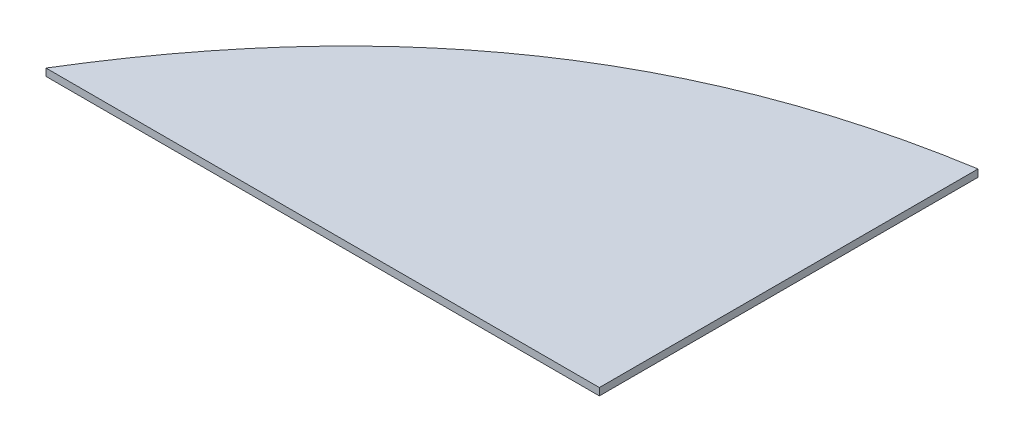
ISO-10303-21;
HEADER;
FILE_DESCRIPTION(('STEP AP214'),'2;1');
FILE_NAME('part.step','',(''),(''),'','','');
FILE_SCHEMA(('AUTOMOTIVE_DESIGN { 1 0 10303 214 1 1 1 1 }'));
ENDSEC;
DATA;
#1=APPLICATION_CONTEXT('core data for automotive mechanical design processes');
#2=APPLICATION_PROTOCOL_DEFINITION('international standard','automotive_design',2000,#1);
#3=PRODUCT_CONTEXT('',#1,'mechanical');
#4=PRODUCT('Part','Part','',(#3));
#5=PRODUCT_RELATED_PRODUCT_CATEGORY('part','',(#4));
#6=PRODUCT_DEFINITION_FORMATION('','',#4);
#7=PRODUCT_DEFINITION_CONTEXT('part definition',#1,'design');
#8=PRODUCT_DEFINITION('design','',#6,#7);
#9=PRODUCT_DEFINITION_SHAPE('','',#8);
#10=(LENGTH_UNIT() NAMED_UNIT(*) SI_UNIT(.MILLI.,.METRE.));
#11=(NAMED_UNIT(*) PLANE_ANGLE_UNIT() SI_UNIT($,.RADIAN.));
#12=(NAMED_UNIT(*) SI_UNIT($,.STERADIAN.) SOLID_ANGLE_UNIT());
#13=UNCERTAINTY_MEASURE_WITH_UNIT(LENGTH_MEASURE(1.E-05),#10,'distance_accuracy_value','');
#14=(GEOMETRIC_REPRESENTATION_CONTEXT(3) GLOBAL_UNCERTAINTY_ASSIGNED_CONTEXT((#13)) GLOBAL_UNIT_ASSIGNED_CONTEXT((#10,
#11,#12)) REPRESENTATION_CONTEXT('',''));
#15=CARTESIAN_POINT('',(0.,0.,0.));
#16=DIRECTION('',(0.,0.,1.));
#17=DIRECTION('',(1.,0.,0.));
#18=AXIS2_PLACEMENT_3D('',#15,#16,#17);
#19=CARTESIAN_POINT('',(-1406.44919894011,1396.06710603677,1451.4545563695));
#20=CARTESIAN_POINT('',(-1290.08783088096,1396.06710603677,1260.52452123556));
#21=CARTESIAN_POINT('',(-1133.97380616354,1396.06710603677,1155.12377366575));
#22=CARTESIAN_POINT('',(-923.849215906296,1396.06710603677,1121.25452346778));
#23=B_SPLINE_CURVE_WITH_KNOTS('',3,(#19,#20,#21,#22),.UNSPECIFIED.,.F.,.F.,(4,4),(0.,1.),.UNSPECIFIED.);
#24=DIRECTION('',(0.,1.,0.));
#25=VECTOR('',#24,1.);
#26=SURFACE_OF_LINEAR_EXTRUSION('',#23,#25);
#27=CARTESIAN_POINT('',(-1406.44919894011,1402.41710603677,1451.4545563695));
#28=CARTESIAN_POINT('',(-1290.08783088096,1402.41710603677,1260.52452123556));
#29=CARTESIAN_POINT('',(-1133.97380616354,1402.41710603677,1155.12377366575));
#30=CARTESIAN_POINT('',(-923.849215906296,1402.41710603677,1121.25452346778));
#31=B_SPLINE_CURVE_WITH_KNOTS('',3,(#27,#28,#29,#30),.UNSPECIFIED.,.F.,.F.,(4,4),(0.,1.),.UNSPECIFIED.);
#32=CARTESIAN_POINT('',(-1406.44919894011,1402.41710603677,1451.4545563695));
#33=VERTEX_POINT('',#32);
#34=CARTESIAN_POINT('',(-923.849215906296,1402.41710603677,1121.25452346778));
#35=VERTEX_POINT('',#34);
#36=EDGE_CURVE('E80',#33,#35,#31,.T.);
#37=ORIENTED_EDGE('',*,*,#36,.T.);
#38=DIRECTION('',(0.,1.,0.));
#39=VECTOR('',#38,1.);
#40=CARTESIAN_POINT('',(-923.849215906296,1396.06710603677,1121.25452346778));
#41=LINE('',#40,#39);
#42=CARTESIAN_POINT('',(-923.849215906296,1396.06710603677,1121.25452346778));
#43=VERTEX_POINT('',#42);
#44=EDGE_CURVE('E11',#43,#35,#41,.T.);
#45=ORIENTED_EDGE('',*,*,#44,.F.);
#46=CARTESIAN_POINT('',(-1406.44919894011,1396.06710603677,1451.4545563695));
#47=VERTEX_POINT('',#46);
#48=EDGE_CURVE('E74',#47,#43,#23,.T.);
#49=ORIENTED_EDGE('',*,*,#48,.F.);
#50=DIRECTION('',(0.,1.,0.));
#51=VECTOR('',#50,1.);
#52=CARTESIAN_POINT('',(-1406.44919894011,1396.06710603677,1451.4545563695));
#53=LINE('',#52,#51);
#54=EDGE_CURVE('E81',#47,#33,#53,.T.);
#55=ORIENTED_EDGE('',*,*,#54,.T.);
#56=EDGE_LOOP('',(#37,#45,#49,#55));
#57=FACE_BOUND('',#56,.T.);
#58=ADVANCED_FACE('F33',(#57),#26,.F.);
#59=CARTESIAN_POINT('',(-923.849215906296,1396.06710603677,1121.25452346778));
#60=DIRECTION('',(-0.999999999999968,0.,2.52088669364014E-07));
#61=DIRECTION('',(2.52088669364014E-07,0.,0.999999999999968));
#62=AXIS2_PLACEMENT_3D('',#59,#60,#61);
#63=PLANE('',#62);
#64=DIRECTION('',(2.52088669364014E-07,0.,0.999999999999968));
#65=VECTOR('',#64,1.);
#66=CARTESIAN_POINT('',(-923.849215906296,1402.41710603677,1121.25452346778));
#67=LINE('',#66,#65);
#68=CARTESIAN_POINT('',(-923.849132666609,1402.41710603677,1451.45455638093));
#69=VERTEX_POINT('',#68);
#70=EDGE_CURVE('E62',#35,#69,#67,.T.);
#71=ORIENTED_EDGE('',*,*,#70,.T.);
#72=DIRECTION('',(0.,1.,0.));
#73=VECTOR('',#72,1.);
#74=CARTESIAN_POINT('',(-923.849132666609,1396.06710603677,1451.45455638093));
#75=LINE('',#74,#73);
#76=CARTESIAN_POINT('',(-923.849132666609,1396.06710603677,1451.45455638093));
#77=VERTEX_POINT('',#76);
#78=EDGE_CURVE('E42',#77,#69,#75,.T.);
#79=ORIENTED_EDGE('',*,*,#78,.F.);
#80=DIRECTION('',(2.52088669364014E-07,0.,0.999999999999968));
#81=VECTOR('',#80,1.);
#82=CARTESIAN_POINT('',(-923.849215906296,1396.06710603677,1121.25452346778));
#83=LINE('',#82,#81);
#84=EDGE_CURVE('E70',#43,#77,#83,.T.);
#85=ORIENTED_EDGE('',*,*,#84,.F.);
#86=ORIENTED_EDGE('',*,*,#44,.T.);
#87=EDGE_LOOP('',(#71,#79,#85,#86));
#88=FACE_BOUND('',#87,.T.);
#89=ADVANCED_FACE('F71',(#88),#63,.F.);
#90=CARTESIAN_POINT('',(-1406.44919894011,1396.06710603677,1451.4545563695));
#91=DIRECTION('',(2.36707982197085E-11,0.,-1.));
#92=DIRECTION('',(-1.,0.,-2.36707982197085E-11));
#93=AXIS2_PLACEMENT_3D('',#90,#91,#92);
#94=PLANE('',#93);
#95=DIRECTION('',(-1.,0.,-2.36707982197085E-11));
#96=VECTOR('',#95,1.);
#97=CARTESIAN_POINT('',(-1406.44919894011,1402.41710603677,1451.4545563695));
#98=LINE('',#97,#96);
#99=EDGE_CURVE('E67',#69,#33,#98,.T.);
#100=ORIENTED_EDGE('',*,*,#99,.T.);
#101=ORIENTED_EDGE('',*,*,#54,.F.);
#102=DIRECTION('',(-1.,0.,-2.36707982197085E-11));
#103=VECTOR('',#102,1.);
#104=CARTESIAN_POINT('',(-1406.44919894011,1396.06710603677,1451.4545563695));
#105=LINE('',#104,#103);
#106=EDGE_CURVE('E50',#77,#47,#105,.T.);
#107=ORIENTED_EDGE('',*,*,#106,.F.);
#108=ORIENTED_EDGE('',*,*,#78,.T.);
#109=EDGE_LOOP('',(#100,#101,#107,#108));
#110=FACE_BOUND('',#109,.T.);
#111=ADVANCED_FACE('F93',(#110),#94,.F.);
#112=CARTESIAN_POINT('',(-1200.31041574749,1396.06710603677,1227.45674556765));
#113=DIRECTION('',(0.,-1.,0.));
#114=DIRECTION('',(0.,0.,-1.));
#115=AXIS2_PLACEMENT_3D('',#112,#113,#114);
#116=PLANE('',#115);
#117=ORIENTED_EDGE('',*,*,#48,.T.);
#118=ORIENTED_EDGE('',*,*,#84,.T.);
#119=ORIENTED_EDGE('',*,*,#106,.T.);
#120=EDGE_LOOP('',(#117,#118,#119));
#121=FACE_BOUND('',#120,.T.);
#122=ADVANCED_FACE('F77',(#121),#116,.T.);
#123=CARTESIAN_POINT('',(-1200.31041574749,1402.41710603677,1227.45674556765));
#124=DIRECTION('',(0.,-1.,0.));
#125=DIRECTION('',(0.,0.,-1.));
#126=AXIS2_PLACEMENT_3D('',#123,#124,#125);
#127=PLANE('',#126);
#128=ORIENTED_EDGE('',*,*,#36,.F.);
#129=ORIENTED_EDGE('',*,*,#99,.F.);
#130=ORIENTED_EDGE('',*,*,#70,.F.);
#131=EDGE_LOOP('',(#128,#129,#130));
#132=FACE_BOUND('',#131,.T.);
#133=ADVANCED_FACE('F94',(#132),#127,.F.);
#134=CLOSED_SHELL('',(#58,#89,#111,#122,#133));
#135=MANIFOLD_SOLID_BREP('B2',#134);
#136=ADVANCED_BREP_SHAPE_REPRESENTATION('',(#18,#135),#14);
#137=SHAPE_DEFINITION_REPRESENTATION(#9,#136);
ENDSEC;
END-ISO-10303-21;
